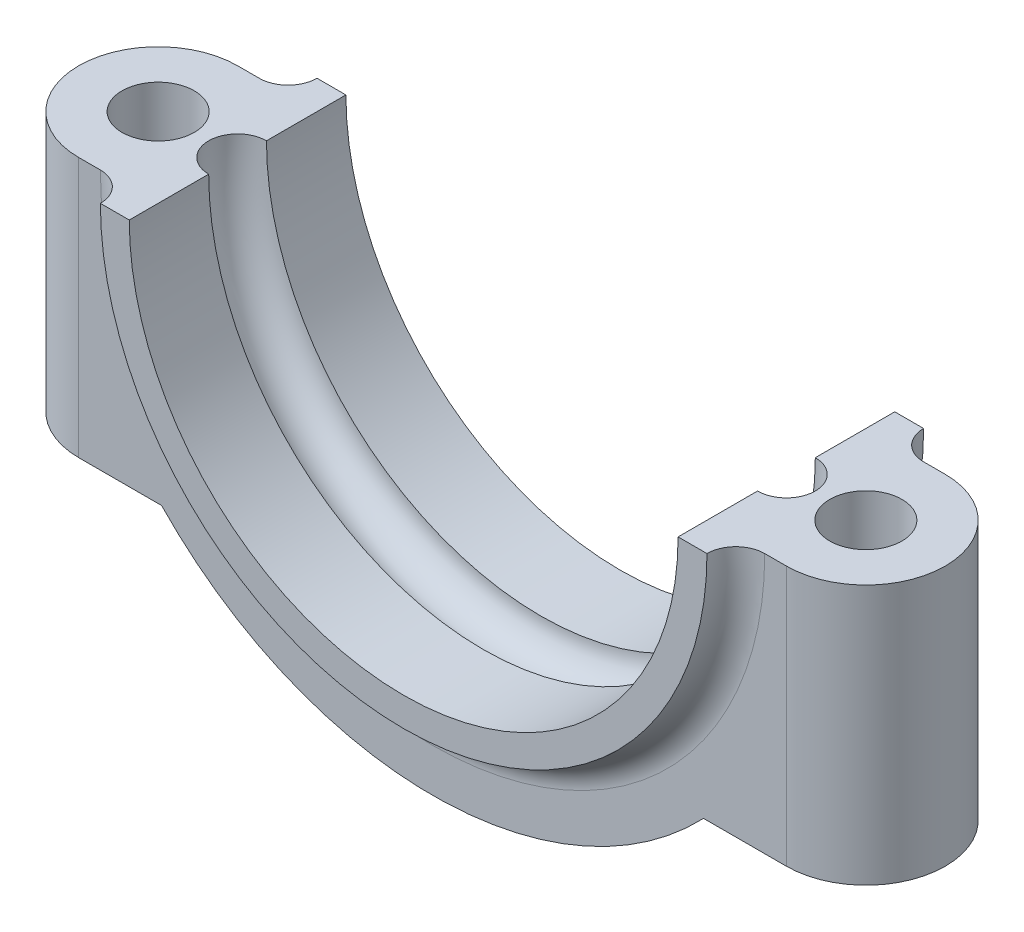
ISO-10303-21;
HEADER;
FILE_DESCRIPTION(('STEP AP214'),'2;1');
FILE_NAME('part.step','',(''),(''),'','','');
FILE_SCHEMA(('AUTOMOTIVE_DESIGN { 1 0 10303 214 1 1 1 1 }'));
ENDSEC;
DATA;
#1=APPLICATION_CONTEXT('core data for automotive mechanical design processes');
#2=APPLICATION_PROTOCOL_DEFINITION('international standard','automotive_design',2000,#1);
#3=PRODUCT_CONTEXT('',#1,'mechanical');
#4=PRODUCT('Part','Part','',(#3));
#5=PRODUCT_RELATED_PRODUCT_CATEGORY('part','',(#4));
#6=PRODUCT_DEFINITION_FORMATION('','',#4);
#7=PRODUCT_DEFINITION_CONTEXT('part definition',#1,'design');
#8=PRODUCT_DEFINITION('design','',#6,#7);
#9=PRODUCT_DEFINITION_SHAPE('','',#8);
#10=(LENGTH_UNIT() NAMED_UNIT(*) SI_UNIT(.MILLI.,.METRE.));
#11=(NAMED_UNIT(*) PLANE_ANGLE_UNIT() SI_UNIT($,.RADIAN.));
#12=(NAMED_UNIT(*) SI_UNIT($,.STERADIAN.) SOLID_ANGLE_UNIT());
#13=UNCERTAINTY_MEASURE_WITH_UNIT(LENGTH_MEASURE(1.E-05),#10,'distance_accuracy_value','');
#14=(GEOMETRIC_REPRESENTATION_CONTEXT(3) GLOBAL_UNCERTAINTY_ASSIGNED_CONTEXT((#13)) GLOBAL_UNIT_ASSIGNED_CONTEXT((#10,
#11,#12)) REPRESENTATION_CONTEXT('',''));
#15=CARTESIAN_POINT('',(0.,0.,0.));
#16=DIRECTION('',(0.,0.,1.));
#17=DIRECTION('',(1.,0.,0.));
#18=AXIS2_PLACEMENT_3D('',#15,#16,#17);
#19=CARTESIAN_POINT('',(24.5,0.,0.));
#20=DIRECTION('',(0.,1.,0.));
#21=DIRECTION('',(-1.,0.,0.));
#22=AXIS2_PLACEMENT_3D('',#19,#20,#21);
#23=CYLINDRICAL_SURFACE('',#22,5.5);
#24=DIRECTION('',(0.,1.,0.));
#25=VECTOR('',#24,1.);
#26=CARTESIAN_POINT('',(24.5,0.,-5.5));
#27=LINE('',#26,#25);
#28=CARTESIAN_POINT('',(24.5,0.,-5.5));
#29=VERTEX_POINT('',#28);
#30=CARTESIAN_POINT('',(24.5,-18.,-5.5));
#31=VERTEX_POINT('',#30);
#32=EDGE_CURVE('E234',#29,#31,#27,.F.);
#33=ORIENTED_EDGE('',*,*,#32,.F.);
#34=CARTESIAN_POINT('',(24.5,0.,0.));
#35=DIRECTION('',(0.,-1.,0.));
#36=DIRECTION('',(1.,0.,0.));
#37=AXIS2_PLACEMENT_3D('',#34,#35,#36);
#38=CIRCLE('',#37,5.5);
#39=CARTESIAN_POINT('',(24.5,0.,5.5));
#40=VERTEX_POINT('',#39);
#41=EDGE_CURVE('E54',#40,#29,#38,.F.);
#42=ORIENTED_EDGE('',*,*,#41,.F.);
#43=DIRECTION('',(0.,-1.,0.));
#44=VECTOR('',#43,1.);
#45=CARTESIAN_POINT('',(24.5,0.,5.5));
#46=LINE('',#45,#44);
#47=CARTESIAN_POINT('',(24.5,-18.,5.5));
#48=VERTEX_POINT('',#47);
#49=EDGE_CURVE('E238',#48,#40,#46,.F.);
#50=ORIENTED_EDGE('',*,*,#49,.F.);
#51=CARTESIAN_POINT('',(24.5,-18.,0.));
#52=DIRECTION('',(0.,1.,0.));
#53=DIRECTION('',(-1.,0.,0.));
#54=AXIS2_PLACEMENT_3D('',#51,#52,#53);
#55=CIRCLE('',#54,5.5);
#56=EDGE_CURVE('E11',#31,#48,#55,.F.);
#57=ORIENTED_EDGE('',*,*,#56,.F.);
#58=EDGE_LOOP('',(#33,#42,#50,#57));
#59=FACE_BOUND('',#58,.T.);
#60=ADVANCED_FACE('F45',(#59),#23,.T.);
#61=CARTESIAN_POINT('',(-24.5,0.,0.));
#62=DIRECTION('',(0.,-1.,0.));
#63=DIRECTION('',(1.,0.,0.));
#64=AXIS2_PLACEMENT_3D('',#61,#62,#63);
#65=CYLINDRICAL_SURFACE('',#64,5.5);
#66=DIRECTION('',(0.,1.,0.));
#67=VECTOR('',#66,1.);
#68=CARTESIAN_POINT('',(-24.5,0.,5.5));
#69=LINE('',#68,#67);
#70=CARTESIAN_POINT('',(-24.5,0.,5.5));
#71=VERTEX_POINT('',#70);
#72=CARTESIAN_POINT('',(-24.5,-18.,5.5));
#73=VERTEX_POINT('',#72);
#74=EDGE_CURVE('E220',#71,#73,#69,.F.);
#75=ORIENTED_EDGE('',*,*,#74,.F.);
#76=CARTESIAN_POINT('',(-24.5,0.,0.));
#77=DIRECTION('',(0.,-1.,0.));
#78=DIRECTION('',(1.,0.,0.));
#79=AXIS2_PLACEMENT_3D('',#76,#77,#78);
#80=CIRCLE('',#79,5.5);
#81=CARTESIAN_POINT('',(-24.5,0.,-5.5));
#82=VERTEX_POINT('',#81);
#83=EDGE_CURVE('E228',#82,#71,#80,.F.);
#84=ORIENTED_EDGE('',*,*,#83,.F.);
#85=DIRECTION('',(0.,-1.,0.));
#86=VECTOR('',#85,1.);
#87=CARTESIAN_POINT('',(-24.5,0.,-5.5));
#88=LINE('',#87,#86);
#89=CARTESIAN_POINT('',(-24.5,-18.,-5.5));
#90=VERTEX_POINT('',#89);
#91=EDGE_CURVE('E224',#90,#82,#88,.F.);
#92=ORIENTED_EDGE('',*,*,#91,.F.);
#93=CARTESIAN_POINT('',(-24.5,-18.,0.));
#94=DIRECTION('',(0.,1.,0.));
#95=DIRECTION('',(-1.,0.,0.));
#96=AXIS2_PLACEMENT_3D('',#93,#94,#95);
#97=CIRCLE('',#96,5.5);
#98=EDGE_CURVE('E231',#73,#90,#97,.F.);
#99=ORIENTED_EDGE('',*,*,#98,.F.);
#100=EDGE_LOOP('',(#75,#84,#92,#99));
#101=FACE_BOUND('',#100,.T.);
#102=ADVANCED_FACE('F338',(#101),#65,.T.);
#103=CARTESIAN_POINT('',(0.,0.,5.5));
#104=DIRECTION('',(0.,0.,-1.));
#105=DIRECTION('',(-1.,0.,0.));
#106=AXIS2_PLACEMENT_3D('',#103,#104,#105);
#107=CYLINDRICAL_SURFACE('',#106,19.);
#108=DIRECTION('',(0.,0.,-1.));
#109=VECTOR('',#108,1.);
#110=CARTESIAN_POINT('',(19.,0.,5.5));
#111=LINE('',#110,#109);
#112=CARTESIAN_POINT('',(19.,0.,7.5));
#113=VERTEX_POINT('',#112);
#114=CARTESIAN_POINT('',(19.,0.,2.));
#115=VERTEX_POINT('',#114);
#116=EDGE_CURVE('E173',#113,#115,#111,.T.);
#117=ORIENTED_EDGE('',*,*,#116,.T.);
#118=CARTESIAN_POINT('',(0.,0.,2.));
#119=DIRECTION('',(0.,0.,-1.));
#120=DIRECTION('',(-1.,0.,0.));
#121=AXIS2_PLACEMENT_3D('',#118,#119,#120);
#122=CIRCLE('',#121,19.);
#123=CARTESIAN_POINT('',(-19.,0.,2.));
#124=VERTEX_POINT('',#123);
#125=EDGE_CURVE('E150',#115,#124,#122,.T.);
#126=ORIENTED_EDGE('',*,*,#125,.T.);
#127=DIRECTION('',(0.,0.,-1.));
#128=VECTOR('',#127,1.);
#129=CARTESIAN_POINT('',(-19.,0.,5.5));
#130=LINE('',#129,#128);
#131=CARTESIAN_POINT('',(-19.,0.,7.5));
#132=VERTEX_POINT('',#131);
#133=EDGE_CURVE('E156',#132,#124,#130,.T.);
#134=ORIENTED_EDGE('',*,*,#133,.F.);
#135=CARTESIAN_POINT('',(0.,0.,7.5));
#136=DIRECTION('',(0.,0.,-1.));
#137=DIRECTION('',(1.,0.,0.));
#138=AXIS2_PLACEMENT_3D('',#135,#136,#137);
#139=CIRCLE('',#138,19.);
#140=EDGE_CURVE('E198',#113,#132,#139,.T.);
#141=ORIENTED_EDGE('',*,*,#140,.F.);
#142=EDGE_LOOP('',(#117,#126,#134,#141));
#143=FACE_BOUND('',#142,.T.);
#144=ADVANCED_FACE('F319',(#143),#107,.F.);
#145=CARTESIAN_POINT('',(-19.,0.,-2.));
#146=VERTEX_POINT('',#145);
#147=CARTESIAN_POINT('',(-19.,0.,-7.5));
#148=VERTEX_POINT('',#147);
#149=EDGE_CURVE('E164',#146,#148,#130,.T.);
#150=ORIENTED_EDGE('',*,*,#149,.F.);
#151=CARTESIAN_POINT('',(0.,0.,-2.));
#152=DIRECTION('',(0.,0.,1.));
#153=DIRECTION('',(1.,0.,0.));
#154=AXIS2_PLACEMENT_3D('',#151,#152,#153);
#155=CIRCLE('',#154,19.);
#156=CARTESIAN_POINT('',(19.,0.,-2.));
#157=VERTEX_POINT('',#156);
#158=EDGE_CURVE('E147',#146,#157,#155,.T.);
#159=ORIENTED_EDGE('',*,*,#158,.T.);
#160=CARTESIAN_POINT('',(19.,0.,-7.5));
#161=VERTEX_POINT('',#160);
#162=EDGE_CURVE('E162',#157,#161,#111,.T.);
#163=ORIENTED_EDGE('',*,*,#162,.T.);
#164=CARTESIAN_POINT('',(0.,0.,-7.5));
#165=DIRECTION('',(0.,0.,-1.));
#166=DIRECTION('',(1.,0.,0.));
#167=AXIS2_PLACEMENT_3D('',#164,#165,#166);
#168=CIRCLE('',#167,19.);
#169=EDGE_CURVE('E285',#161,#148,#168,.T.);
#170=ORIENTED_EDGE('',*,*,#169,.T.);
#171=EDGE_LOOP('',(#150,#159,#163,#170));
#172=FACE_BOUND('',#171,.T.);
#173=ADVANCED_FACE('F160',(#172),#107,.F.);
#174=CARTESIAN_POINT('',(-19.,0.,5.5));
#175=DIRECTION('',(0.,-1.,0.));
#176=DIRECTION('',(1.,0.,0.));
#177=AXIS2_PLACEMENT_3D('',#174,#175,#176);
#178=PLANE('',#177);
#179=CARTESIAN_POINT('',(-24.5,0.,0.));
#180=DIRECTION('',(0.,1.,0.));
#181=DIRECTION('',(1.,0.,0.));
#182=AXIS2_PLACEMENT_3D('',#179,#180,#181);
#183=CIRCLE('',#182,2.5);
#184=CARTESIAN_POINT('',(-22.,0.,0.));
#185=VERTEX_POINT('',#184);
#186=EDGE_CURVE('E307',#185,#185,#183,.T.);
#187=ORIENTED_EDGE('',*,*,#186,.F.);
#188=EDGE_LOOP('',(#187));
#189=FACE_BOUND('',#188,.T.);
#190=DIRECTION('',(-1.,0.,0.));
#191=VECTOR('',#190,1.);
#192=CARTESIAN_POINT('',(-19.,0.,-5.5));
#193=LINE('',#192,#191);
#194=CARTESIAN_POINT('',(-23.,0.,-5.5));
#195=VERTEX_POINT('',#194);
#196=EDGE_CURVE('E263',#195,#82,#193,.T.);
#197=ORIENTED_EDGE('',*,*,#196,.T.);
#198=ORIENTED_EDGE('',*,*,#83,.T.);
#199=DIRECTION('',(-1.,0.,0.));
#200=VECTOR('',#199,1.);
#201=CARTESIAN_POINT('',(-19.,0.,5.5));
#202=LINE('',#201,#200);
#203=CARTESIAN_POINT('',(-23.,0.,5.5));
#204=VERTEX_POINT('',#203);
#205=EDGE_CURVE('E249',#204,#71,#202,.T.);
#206=ORIENTED_EDGE('',*,*,#205,.F.);
#207=CARTESIAN_POINT('',(-23.,0.,7.5));
#208=DIRECTION('',(0.,-1.,0.));
#209=DIRECTION('',(1.,0.,0.));
#210=AXIS2_PLACEMENT_3D('',#207,#208,#209);
#211=CIRCLE('',#210,2.);
#212=CARTESIAN_POINT('',(-21.,0.,7.5));
#213=VERTEX_POINT('',#212);
#214=EDGE_CURVE('E217',#204,#213,#211,.T.);
#215=ORIENTED_EDGE('',*,*,#214,.T.);
#216=DIRECTION('',(-1.,0.,0.));
#217=VECTOR('',#216,1.);
#218=CARTESIAN_POINT('',(-21.,0.,7.5));
#219=LINE('',#218,#217);
#220=EDGE_CURVE('E296',#132,#213,#219,.T.);
#221=ORIENTED_EDGE('',*,*,#220,.F.);
#222=ORIENTED_EDGE('',*,*,#133,.T.);
#223=CARTESIAN_POINT('',(-19.,0.,0.));
#224=DIRECTION('',(0.,-1.,0.));
#225=DIRECTION('',(1.,0.,0.));
#226=AXIS2_PLACEMENT_3D('',#223,#224,#225);
#227=CIRCLE('',#226,2.);
#228=EDGE_CURVE('E311',#124,#146,#227,.T.);
#229=ORIENTED_EDGE('',*,*,#228,.T.);
#230=ORIENTED_EDGE('',*,*,#149,.T.);
#231=DIRECTION('',(-1.,0.,0.));
#232=VECTOR('',#231,1.);
#233=CARTESIAN_POINT('',(-21.,0.,-7.5));
#234=LINE('',#233,#232);
#235=CARTESIAN_POINT('',(-21.,0.,-7.5));
#236=VERTEX_POINT('',#235);
#237=EDGE_CURVE('E281',#148,#236,#234,.T.);
#238=ORIENTED_EDGE('',*,*,#237,.T.);
#239=CARTESIAN_POINT('',(-23.,0.,-7.5));
#240=DIRECTION('',(0.,-1.,0.));
#241=DIRECTION('',(1.,0.,0.));
#242=AXIS2_PLACEMENT_3D('',#239,#240,#241);
#243=CIRCLE('',#242,2.);
#244=EDGE_CURVE('E210',#236,#195,#243,.T.);
#245=ORIENTED_EDGE('',*,*,#244,.T.);
#246=EDGE_LOOP('',(#197,#198,#206,#215,#221,#222,#229,#230,#238,#245));
#247=FACE_BOUND('',#246,.T.);
#248=ADVANCED_FACE('F323',(#189,#247),#178,.F.);
#249=CARTESIAN_POINT('',(-30.,-18.,5.5));
#250=DIRECTION('',(0.,1.,0.));
#251=DIRECTION('',(-1.,0.,0.));
#252=AXIS2_PLACEMENT_3D('',#249,#250,#251);
#253=PLANE('',#252);
#254=CARTESIAN_POINT('',(-24.5,-18.,0.));
#255=DIRECTION('',(0.,1.,0.));
#256=DIRECTION('',(-1.,0.,0.));
#257=AXIS2_PLACEMENT_3D('',#254,#255,#256);
#258=CIRCLE('',#257,2.5);
#259=CARTESIAN_POINT('',(-27.,-18.,0.));
#260=VERTEX_POINT('',#259);
#261=EDGE_CURVE('E195',#260,#260,#258,.T.);
#262=ORIENTED_EDGE('',*,*,#261,.T.);
#263=EDGE_LOOP('',(#262));
#264=FACE_BOUND('',#263,.T.);
#265=DIRECTION('',(1.,0.,0.));
#266=VECTOR('',#265,1.);
#267=CARTESIAN_POINT('',(-30.,-18.,5.5));
#268=LINE('',#267,#266);
#269=CARTESIAN_POINT('',(-18.7616630392937,-18.,5.5));
#270=VERTEX_POINT('',#269);
#271=EDGE_CURVE('E254',#73,#270,#268,.T.);
#272=ORIENTED_EDGE('',*,*,#271,.F.);
#273=ORIENTED_EDGE('',*,*,#98,.T.);
#274=DIRECTION('',(1.,0.,0.));
#275=VECTOR('',#274,1.);
#276=CARTESIAN_POINT('',(-30.,-18.,-5.5));
#277=LINE('',#276,#275);
#278=CARTESIAN_POINT('',(-18.7616630392937,-18.,-5.5));
#279=VERTEX_POINT('',#278);
#280=EDGE_CURVE('E258',#90,#279,#277,.T.);
#281=ORIENTED_EDGE('',*,*,#280,.T.);
#282=DIRECTION('',(0.,0.,-1.));
#283=VECTOR('',#282,1.);
#284=CARTESIAN_POINT('',(-18.7616630392937,-18.,5.5));
#285=LINE('',#284,#283);
#286=EDGE_CURVE('E188',#270,#279,#285,.T.);
#287=ORIENTED_EDGE('',*,*,#286,.F.);
#288=EDGE_LOOP('',(#272,#273,#281,#287));
#289=FACE_BOUND('',#288,.T.);
#290=ADVANCED_FACE('F342',(#264,#289),#253,.F.);
#291=CARTESIAN_POINT('',(0.,0.,5.5));
#292=DIRECTION('',(0.,0.,-1.));
#293=DIRECTION('',(-1.,0.,0.));
#294=AXIS2_PLACEMENT_3D('',#291,#292,#293);
#295=CYLINDRICAL_SURFACE('',#294,26.);
#296=CARTESIAN_POINT('',(0.,0.,-5.5));
#297=DIRECTION('',(0.,0.,1.));
#298=DIRECTION('',(1.,0.,0.));
#299=AXIS2_PLACEMENT_3D('',#296,#297,#298);
#300=CIRCLE('',#299,26.);
#301=CARTESIAN_POINT('',(18.7616630392937,-18.,-5.5));
#302=VERTEX_POINT('',#301);
#303=EDGE_CURVE('E256',#279,#302,#300,.T.);
#304=ORIENTED_EDGE('',*,*,#303,.T.);
#305=DIRECTION('',(0.,0.,-1.));
#306=VECTOR('',#305,1.);
#307=CARTESIAN_POINT('',(18.7616630392937,-18.,5.5));
#308=LINE('',#307,#306);
#309=CARTESIAN_POINT('',(18.7616630392937,-18.,5.5));
#310=VERTEX_POINT('',#309);
#311=EDGE_CURVE('E178',#310,#302,#308,.T.);
#312=ORIENTED_EDGE('',*,*,#311,.F.);
#313=CARTESIAN_POINT('',(0.,0.,5.5));
#314=DIRECTION('',(0.,0.,1.));
#315=DIRECTION('',(1.,0.,0.));
#316=AXIS2_PLACEMENT_3D('',#313,#314,#315);
#317=CIRCLE('',#316,26.);
#318=EDGE_CURVE('E270',#270,#310,#317,.T.);
#319=ORIENTED_EDGE('',*,*,#318,.F.);
#320=ORIENTED_EDGE('',*,*,#286,.T.);
#321=EDGE_LOOP('',(#304,#312,#319,#320));
#322=FACE_BOUND('',#321,.T.);
#323=ADVANCED_FACE('F348',(#322),#295,.T.);
#324=CARTESIAN_POINT('',(30.,-18.,5.5));
#325=DIRECTION('',(0.,1.,0.));
#326=DIRECTION('',(-1.,0.,0.));
#327=AXIS2_PLACEMENT_3D('',#324,#325,#326);
#328=PLANE('',#327);
#329=CARTESIAN_POINT('',(24.5,-18.,0.));
#330=DIRECTION('',(0.,1.,0.));
#331=DIRECTION('',(-1.,0.,0.));
#332=AXIS2_PLACEMENT_3D('',#329,#330,#331);
#333=CIRCLE('',#332,2.5);
#334=CARTESIAN_POINT('',(22.,-18.,0.));
#335=VERTEX_POINT('',#334);
#336=EDGE_CURVE('E199',#335,#335,#333,.T.);
#337=ORIENTED_EDGE('',*,*,#336,.T.);
#338=EDGE_LOOP('',(#337));
#339=FACE_BOUND('',#338,.T.);
#340=DIRECTION('',(1.,0.,0.));
#341=VECTOR('',#340,1.);
#342=CARTESIAN_POINT('',(30.,-18.,-5.5));
#343=LINE('',#342,#341);
#344=EDGE_CURVE('E250',#302,#31,#343,.T.);
#345=ORIENTED_EDGE('',*,*,#344,.T.);
#346=ORIENTED_EDGE('',*,*,#56,.T.);
#347=DIRECTION('',(1.,0.,0.));
#348=VECTOR('',#347,1.);
#349=CARTESIAN_POINT('',(30.,-18.,5.5));
#350=LINE('',#349,#348);
#351=EDGE_CURVE('E179',#310,#48,#350,.T.);
#352=ORIENTED_EDGE('',*,*,#351,.F.);
#353=ORIENTED_EDGE('',*,*,#311,.T.);
#354=EDGE_LOOP('',(#345,#346,#352,#353));
#355=FACE_BOUND('',#354,.T.);
#356=ADVANCED_FACE('F349',(#339,#355),#328,.F.);
#357=CARTESIAN_POINT('',(19.,0.,5.5));
#358=DIRECTION('',(0.,-1.,0.));
#359=DIRECTION('',(1.,0.,0.));
#360=AXIS2_PLACEMENT_3D('',#357,#358,#359);
#361=PLANE('',#360);
#362=CARTESIAN_POINT('',(24.5,0.,0.));
#363=DIRECTION('',(0.,1.,0.));
#364=DIRECTION('',(-1.,0.,0.));
#365=AXIS2_PLACEMENT_3D('',#362,#363,#364);
#366=CIRCLE('',#365,2.5);
#367=CARTESIAN_POINT('',(22.,0.,0.));
#368=VERTEX_POINT('',#367);
#369=EDGE_CURVE('E306',#368,#368,#366,.T.);
#370=ORIENTED_EDGE('',*,*,#369,.F.);
#371=EDGE_LOOP('',(#370));
#372=FACE_BOUND('',#371,.T.);
#373=DIRECTION('',(-1.,0.,0.));
#374=VECTOR('',#373,1.);
#375=CARTESIAN_POINT('',(19.,0.,5.5));
#376=LINE('',#375,#374);
#377=CARTESIAN_POINT('',(23.,0.,5.5));
#378=VERTEX_POINT('',#377);
#379=EDGE_CURVE('E174',#40,#378,#376,.T.);
#380=ORIENTED_EDGE('',*,*,#379,.F.);
#381=ORIENTED_EDGE('',*,*,#41,.T.);
#382=DIRECTION('',(-1.,0.,0.));
#383=VECTOR('',#382,1.);
#384=CARTESIAN_POINT('',(19.,0.,-5.5));
#385=LINE('',#384,#383);
#386=CARTESIAN_POINT('',(23.,0.,-5.5));
#387=VERTEX_POINT('',#386);
#388=EDGE_CURVE('E183',#29,#387,#385,.T.);
#389=ORIENTED_EDGE('',*,*,#388,.T.);
#390=CARTESIAN_POINT('',(23.,0.,-7.5));
#391=DIRECTION('',(0.,-1.,0.));
#392=DIRECTION('',(1.,0.,0.));
#393=AXIS2_PLACEMENT_3D('',#390,#391,#392);
#394=CIRCLE('',#393,2.);
#395=CARTESIAN_POINT('',(21.,0.,-7.5));
#396=VERTEX_POINT('',#395);
#397=EDGE_CURVE('E207',#387,#396,#394,.T.);
#398=ORIENTED_EDGE('',*,*,#397,.T.);
#399=DIRECTION('',(-1.,0.,0.));
#400=VECTOR('',#399,1.);
#401=CARTESIAN_POINT('',(19.,0.,-7.5));
#402=LINE('',#401,#400);
#403=EDGE_CURVE('E171',#396,#161,#402,.T.);
#404=ORIENTED_EDGE('',*,*,#403,.T.);
#405=ORIENTED_EDGE('',*,*,#162,.F.);
#406=CARTESIAN_POINT('',(19.,0.,0.));
#407=DIRECTION('',(0.,-1.,0.));
#408=DIRECTION('',(1.,0.,0.));
#409=AXIS2_PLACEMENT_3D('',#406,#407,#408);
#410=CIRCLE('',#409,2.);
#411=EDGE_CURVE('E144',#157,#115,#410,.T.);
#412=ORIENTED_EDGE('',*,*,#411,.T.);
#413=ORIENTED_EDGE('',*,*,#116,.F.);
#414=DIRECTION('',(-1.,0.,0.));
#415=VECTOR('',#414,1.);
#416=CARTESIAN_POINT('',(19.,0.,7.5));
#417=LINE('',#416,#415);
#418=CARTESIAN_POINT('',(21.,0.,7.5));
#419=VERTEX_POINT('',#418);
#420=EDGE_CURVE('E288',#419,#113,#417,.T.);
#421=ORIENTED_EDGE('',*,*,#420,.F.);
#422=CARTESIAN_POINT('',(23.,0.,7.5));
#423=DIRECTION('',(0.,-1.,0.));
#424=DIRECTION('',(1.,0.,0.));
#425=AXIS2_PLACEMENT_3D('',#422,#423,#424);
#426=CIRCLE('',#425,2.);
#427=EDGE_CURVE('E213',#419,#378,#426,.T.);
#428=ORIENTED_EDGE('',*,*,#427,.T.);
#429=EDGE_LOOP('',(#380,#381,#389,#398,#404,#405,#412,#413,#421,#428));
#430=FACE_BOUND('',#429,.T.);
#431=ADVANCED_FACE('F169',(#372,#430),#361,.F.);
#432=CARTESIAN_POINT('',(0.,0.,5.5));
#433=DIRECTION('',(0.,0.,1.));
#434=DIRECTION('',(1.,0.,0.));
#435=AXIS2_PLACEMENT_3D('',#432,#433,#434);
#436=PLANE('',#435);
#437=ORIENTED_EDGE('',*,*,#351,.T.);
#438=ORIENTED_EDGE('',*,*,#49,.T.);
#439=ORIENTED_EDGE('',*,*,#379,.T.);
#440=CARTESIAN_POINT('',(0.,0.,5.5));
#441=DIRECTION('',(0.,0.,1.));
#442=DIRECTION('',(1.,0.,0.));
#443=AXIS2_PLACEMENT_3D('',#440,#441,#442);
#444=CIRCLE('',#443,23.);
#445=EDGE_CURVE('E204',#378,#204,#444,.F.);
#446=ORIENTED_EDGE('',*,*,#445,.T.);
#447=ORIENTED_EDGE('',*,*,#205,.T.);
#448=ORIENTED_EDGE('',*,*,#74,.T.);
#449=ORIENTED_EDGE('',*,*,#271,.T.);
#450=ORIENTED_EDGE('',*,*,#318,.T.);
#451=EDGE_LOOP('',(#437,#438,#439,#446,#447,#448,#449,#450));
#452=FACE_BOUND('',#451,.T.);
#453=ADVANCED_FACE('F334',(#452),#436,.T.);
#454=CARTESIAN_POINT('',(0.,0.,-5.5));
#455=DIRECTION('',(0.,0.,1.));
#456=DIRECTION('',(1.,0.,0.));
#457=AXIS2_PLACEMENT_3D('',#454,#455,#456);
#458=PLANE('',#457);
#459=ORIENTED_EDGE('',*,*,#388,.F.);
#460=ORIENTED_EDGE('',*,*,#32,.T.);
#461=ORIENTED_EDGE('',*,*,#344,.F.);
#462=ORIENTED_EDGE('',*,*,#303,.F.);
#463=ORIENTED_EDGE('',*,*,#280,.F.);
#464=ORIENTED_EDGE('',*,*,#91,.T.);
#465=ORIENTED_EDGE('',*,*,#196,.F.);
#466=CARTESIAN_POINT('',(0.,0.,-5.5));
#467=DIRECTION('',(0.,0.,1.));
#468=DIRECTION('',(1.,0.,0.));
#469=AXIS2_PLACEMENT_3D('',#466,#467,#468);
#470=CIRCLE('',#469,23.);
#471=EDGE_CURVE('E155',#195,#387,#470,.T.);
#472=ORIENTED_EDGE('',*,*,#471,.T.);
#473=EDGE_LOOP('',(#459,#460,#461,#462,#463,#464,#465,#472));
#474=FACE_BOUND('',#473,.T.);
#475=ADVANCED_FACE('F245',(#474),#458,.F.);
#476=CARTESIAN_POINT('',(0.,0.,-7.5));
#477=DIRECTION('',(0.,0.,1.));
#478=DIRECTION('',(1.,0.,0.));
#479=AXIS2_PLACEMENT_3D('',#476,#477,#478);
#480=PLANE('',#479);
#481=ORIENTED_EDGE('',*,*,#169,.F.);
#482=ORIENTED_EDGE('',*,*,#403,.F.);
#483=CARTESIAN_POINT('',(0.,0.,-7.5));
#484=DIRECTION('',(0.,0.,1.));
#485=DIRECTION('',(1.,0.,0.));
#486=AXIS2_PLACEMENT_3D('',#483,#484,#485);
#487=CIRCLE('',#486,21.);
#488=EDGE_CURVE('E277',#236,#396,#487,.T.);
#489=ORIENTED_EDGE('',*,*,#488,.F.);
#490=ORIENTED_EDGE('',*,*,#237,.F.);
#491=EDGE_LOOP('',(#481,#482,#489,#490));
#492=FACE_BOUND('',#491,.T.);
#493=ADVANCED_FACE('F354',(#492),#480,.F.);
#494=CARTESIAN_POINT('',(0.,0.,7.5));
#495=DIRECTION('',(0.,0.,1.));
#496=DIRECTION('',(1.,0.,0.));
#497=AXIS2_PLACEMENT_3D('',#494,#495,#496);
#498=PLANE('',#497);
#499=ORIENTED_EDGE('',*,*,#140,.T.);
#500=ORIENTED_EDGE('',*,*,#220,.T.);
#501=CARTESIAN_POINT('',(0.,0.,7.5));
#502=DIRECTION('',(0.,0.,1.));
#503=DIRECTION('',(1.,0.,0.));
#504=AXIS2_PLACEMENT_3D('',#501,#502,#503);
#505=CIRCLE('',#504,21.);
#506=EDGE_CURVE('E292',#213,#419,#505,.T.);
#507=ORIENTED_EDGE('',*,*,#506,.T.);
#508=ORIENTED_EDGE('',*,*,#420,.T.);
#509=EDGE_LOOP('',(#499,#500,#507,#508));
#510=FACE_BOUND('',#509,.T.);
#511=ADVANCED_FACE('F328',(#510),#498,.T.);
#512=CARTESIAN_POINT('',(24.5,-26.,0.));
#513=DIRECTION('',(0.,1.,0.));
#514=DIRECTION('',(-1.,0.,0.));
#515=AXIS2_PLACEMENT_3D('',#512,#513,#514);
#516=CYLINDRICAL_SURFACE('',#515,2.5);
#517=ORIENTED_EDGE('',*,*,#369,.T.);
#518=EDGE_LOOP('',(#517));
#519=FACE_BOUND('',#518,.T.);
#520=ORIENTED_EDGE('',*,*,#336,.F.);
#521=EDGE_LOOP('',(#520));
#522=FACE_BOUND('',#521,.T.);
#523=ADVANCED_FACE('F363',(#519,#522),#516,.F.);
#524=CARTESIAN_POINT('',(-24.5,-26.,0.));
#525=DIRECTION('',(0.,1.,0.));
#526=DIRECTION('',(-1.,0.,0.));
#527=AXIS2_PLACEMENT_3D('',#524,#525,#526);
#528=CYLINDRICAL_SURFACE('',#527,2.5);
#529=ORIENTED_EDGE('',*,*,#186,.T.);
#530=EDGE_LOOP('',(#529));
#531=FACE_BOUND('',#530,.T.);
#532=ORIENTED_EDGE('',*,*,#261,.F.);
#533=EDGE_LOOP('',(#532));
#534=FACE_BOUND('',#533,.T.);
#535=ADVANCED_FACE('F468',(#531,#534),#528,.F.);
#536=CARTESIAN_POINT('',(0.,0.,0.));
#537=DIRECTION('',(0.,0.,1.));
#538=DIRECTION('',(1.,0.,0.));
#539=AXIS2_PLACEMENT_3D('',#536,#537,#538);
#540=TOROIDAL_SURFACE('',#539,19.,2.);
#541=ORIENTED_EDGE('',*,*,#125,.F.);
#542=ORIENTED_EDGE('',*,*,#411,.F.);
#543=ORIENTED_EDGE('',*,*,#158,.F.);
#544=ORIENTED_EDGE('',*,*,#228,.F.);
#545=EDGE_LOOP('',(#541,#542,#543,#544));
#546=FACE_BOUND('',#545,.T.);
#547=ADVANCED_FACE('F146',(#546),#540,.F.);
#548=CARTESIAN_POINT('',(0.,0.,-7.5));
#549=DIRECTION('',(0.,0.,1.));
#550=DIRECTION('',(1.,0.,0.));
#551=AXIS2_PLACEMENT_3D('',#548,#549,#550);
#552=TOROIDAL_SURFACE('',#551,23.,2.);
#553=ORIENTED_EDGE('',*,*,#244,.F.);
#554=ORIENTED_EDGE('',*,*,#488,.T.);
#555=ORIENTED_EDGE('',*,*,#397,.F.);
#556=ORIENTED_EDGE('',*,*,#471,.F.);
#557=EDGE_LOOP('',(#553,#554,#555,#556));
#558=FACE_BOUND('',#557,.T.);
#559=ADVANCED_FACE('F352',(#558),#552,.F.);
#560=CARTESIAN_POINT('',(0.,0.,7.5));
#561=DIRECTION('',(0.,0.,1.));
#562=DIRECTION('',(1.,0.,0.));
#563=AXIS2_PLACEMENT_3D('',#560,#561,#562);
#564=TOROIDAL_SURFACE('',#563,23.,2.);
#565=ORIENTED_EDGE('',*,*,#214,.F.);
#566=ORIENTED_EDGE('',*,*,#445,.F.);
#567=ORIENTED_EDGE('',*,*,#427,.F.);
#568=ORIENTED_EDGE('',*,*,#506,.F.);
#569=EDGE_LOOP('',(#565,#566,#567,#568));
#570=FACE_BOUND('',#569,.T.);
#571=ADVANCED_FACE('F332',(#570),#564,.F.);
#572=CLOSED_SHELL('',(#60,#102,#144,#173,#248,#290,#323,#356,#431,#453,#475,#493,#511,#523,#535,
#547,#559,#571));
#573=MANIFOLD_SOLID_BREP('B2',#572);
#574=ADVANCED_BREP_SHAPE_REPRESENTATION('',(#18,#573),#14);
#575=SHAPE_DEFINITION_REPRESENTATION(#9,#574);
ENDSEC;
END-ISO-10303-21;
